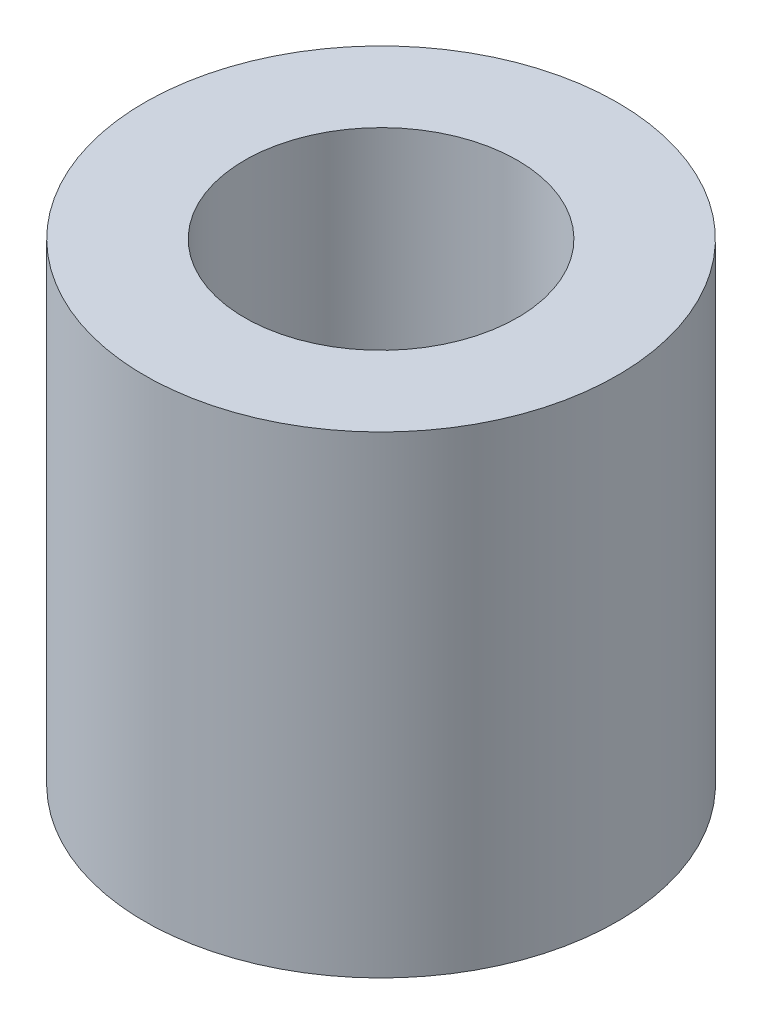
ISO-10303-21;
HEADER;
FILE_DESCRIPTION(('STEP AP214'),'2;1');
FILE_NAME('part.step','',(''),(''),'','','');
FILE_SCHEMA(('AUTOMOTIVE_DESIGN { 1 0 10303 214 1 1 1 1 }'));
ENDSEC;
DATA;
#1=APPLICATION_CONTEXT('core data for automotive mechanical design processes');
#2=APPLICATION_PROTOCOL_DEFINITION('international standard','automotive_design',2000,#1);
#3=PRODUCT_CONTEXT('',#1,'mechanical');
#4=PRODUCT('Part','Part','',(#3));
#5=PRODUCT_RELATED_PRODUCT_CATEGORY('part','',(#4));
#6=PRODUCT_DEFINITION_FORMATION('','',#4);
#7=PRODUCT_DEFINITION_CONTEXT('part definition',#1,'design');
#8=PRODUCT_DEFINITION('design','',#6,#7);
#9=PRODUCT_DEFINITION_SHAPE('','',#8);
#10=(LENGTH_UNIT() NAMED_UNIT(*) SI_UNIT(.MILLI.,.METRE.));
#11=(NAMED_UNIT(*) PLANE_ANGLE_UNIT() SI_UNIT($,.RADIAN.));
#12=(NAMED_UNIT(*) SI_UNIT($,.STERADIAN.) SOLID_ANGLE_UNIT());
#13=UNCERTAINTY_MEASURE_WITH_UNIT(LENGTH_MEASURE(1.E-05),#10,'distance_accuracy_value','');
#14=(GEOMETRIC_REPRESENTATION_CONTEXT(3) GLOBAL_UNCERTAINTY_ASSIGNED_CONTEXT((#13)) GLOBAL_UNIT_ASSIGNED_CONTEXT((#10,
#11,#12)) REPRESENTATION_CONTEXT('',''));
#15=CARTESIAN_POINT('',(0.,0.,0.));
#16=DIRECTION('',(0.,0.,1.));
#17=DIRECTION('',(1.,0.,0.));
#18=AXIS2_PLACEMENT_3D('',#15,#16,#17);
#19=CARTESIAN_POINT('',(0.,10.31875,0.));
#20=DIRECTION('',(0.,-1.,0.));
#21=DIRECTION('',(0.,0.,-1.));
#22=AXIS2_PLACEMENT_3D('',#19,#20,#21);
#23=PLANE('',#22);
#24=CARTESIAN_POINT('',(0.,10.31875,0.));
#25=DIRECTION('',(0.,-1.,0.));
#26=DIRECTION('',(0.,0.,-1.));
#27=AXIS2_PLACEMENT_3D('',#24,#25,#26);
#28=CIRCLE('',#27,10.31875);
#29=CARTESIAN_POINT('',(0.,10.31875,-10.31875));
#30=VERTEX_POINT('',#29);
#31=EDGE_CURVE('E55',#30,#30,#28,.T.);
#32=ORIENTED_EDGE('',*,*,#31,.F.);
#33=EDGE_LOOP('',(#32));
#34=FACE_BOUND('',#33,.T.);
#35=CARTESIAN_POINT('',(0.,10.31875,0.));
#36=DIRECTION('',(0.,-1.,0.));
#37=DIRECTION('',(0.,0.,-1.));
#38=AXIS2_PLACEMENT_3D('',#35,#36,#37);
#39=CIRCLE('',#38,5.953125);
#40=CARTESIAN_POINT('',(0.,10.31875,-5.953125));
#41=VERTEX_POINT('',#40);
#42=EDGE_CURVE('E10',#41,#41,#39,.T.);
#43=ORIENTED_EDGE('',*,*,#42,.T.);
#44=EDGE_LOOP('',(#43));
#45=FACE_BOUND('',#44,.T.);
#46=ADVANCED_FACE('F33',(#34,#45),#23,.F.);
#47=CARTESIAN_POINT('',(0.,0.,0.));
#48=DIRECTION('',(0.,-1.,0.));
#49=DIRECTION('',(0.,0.,-1.));
#50=AXIS2_PLACEMENT_3D('',#47,#48,#49);
#51=CYLINDRICAL_SURFACE('',#50,5.953125);
#52=CARTESIAN_POINT('',(0.,-0.793749999999999,0.));
#53=DIRECTION('',(0.,-1.,0.));
#54=DIRECTION('',(0.,0.,-1.));
#55=AXIS2_PLACEMENT_3D('',#52,#53,#54);
#56=CIRCLE('',#55,5.953125);
#57=CARTESIAN_POINT('',(0.,-0.793749999999999,-5.953125));
#58=VERTEX_POINT('',#57);
#59=EDGE_CURVE('E39',#58,#58,#56,.T.);
#60=ORIENTED_EDGE('',*,*,#59,.T.);
#61=EDGE_LOOP('',(#60));
#62=FACE_BOUND('',#61,.T.);
#63=ORIENTED_EDGE('',*,*,#42,.F.);
#64=EDGE_LOOP('',(#63));
#65=FACE_BOUND('',#64,.T.);
#66=ADVANCED_FACE('F63',(#62,#65),#51,.F.);
#67=CARTESIAN_POINT('',(0.,-0.79375,0.));
#68=DIRECTION('',(0.,-1.,0.));
#69=DIRECTION('',(0.,0.,-1.));
#70=AXIS2_PLACEMENT_3D('',#67,#68,#69);
#71=PLANE('',#70);
#72=ORIENTED_EDGE('',*,*,#59,.F.);
#73=EDGE_LOOP('',(#72));
#74=FACE_BOUND('',#73,.T.);
#75=CARTESIAN_POINT('',(0.,-0.79375,0.));
#76=DIRECTION('',(0.,-1.,0.));
#77=DIRECTION('',(0.,0.,-1.));
#78=AXIS2_PLACEMENT_3D('',#75,#76,#77);
#79=CIRCLE('',#78,3.175);
#80=CARTESIAN_POINT('',(0.,-0.79375,-3.175));
#81=VERTEX_POINT('',#80);
#82=EDGE_CURVE('E43',#81,#81,#79,.T.);
#83=ORIENTED_EDGE('',*,*,#82,.T.);
#84=EDGE_LOOP('',(#83));
#85=FACE_BOUND('',#84,.T.);
#86=ADVANCED_FACE('F67',(#74,#85),#71,.F.);
#87=CARTESIAN_POINT('',(0.,0.,0.));
#88=DIRECTION('',(0.,-1.,0.));
#89=DIRECTION('',(0.,0.,-1.));
#90=AXIS2_PLACEMENT_3D('',#87,#88,#89);
#91=CYLINDRICAL_SURFACE('',#90,3.175);
#92=ORIENTED_EDGE('',*,*,#82,.F.);
#93=EDGE_LOOP('',(#92));
#94=FACE_BOUND('',#93,.T.);
#95=CARTESIAN_POINT('',(0.,-10.31875,0.));
#96=DIRECTION('',(0.,-1.,0.));
#97=DIRECTION('',(0.,0.,-1.));
#98=AXIS2_PLACEMENT_3D('',#95,#96,#97);
#99=CIRCLE('',#98,3.175);
#100=CARTESIAN_POINT('',(0.,-10.31875,-3.175));
#101=VERTEX_POINT('',#100);
#102=EDGE_CURVE('E47',#101,#101,#99,.T.);
#103=ORIENTED_EDGE('',*,*,#102,.T.);
#104=EDGE_LOOP('',(#103));
#105=FACE_BOUND('',#104,.T.);
#106=ADVANCED_FACE('F71',(#94,#105),#91,.F.);
#107=CARTESIAN_POINT('',(0.,-10.31875,0.));
#108=DIRECTION('',(0.,-1.,0.));
#109=DIRECTION('',(0.,0.,-1.));
#110=AXIS2_PLACEMENT_3D('',#107,#108,#109);
#111=PLANE('',#110);
#112=CARTESIAN_POINT('',(0.,-10.31875,0.));
#113=DIRECTION('',(0.,-1.,0.));
#114=DIRECTION('',(0.,0.,-1.));
#115=AXIS2_PLACEMENT_3D('',#112,#113,#114);
#116=CIRCLE('',#115,10.31875);
#117=CARTESIAN_POINT('',(0.,-10.31875,-10.31875));
#118=VERTEX_POINT('',#117);
#119=EDGE_CURVE('E52',#118,#118,#116,.T.);
#120=ORIENTED_EDGE('',*,*,#119,.T.);
#121=EDGE_LOOP('',(#120));
#122=FACE_BOUND('',#121,.T.);
#123=ORIENTED_EDGE('',*,*,#102,.F.);
#124=EDGE_LOOP('',(#123));
#125=FACE_BOUND('',#124,.T.);
#126=ADVANCED_FACE('F78',(#122,#125),#111,.T.);
#127=CARTESIAN_POINT('',(0.,0.,0.));
#128=DIRECTION('',(0.,-1.,0.));
#129=DIRECTION('',(0.,0.,-1.));
#130=AXIS2_PLACEMENT_3D('',#127,#128,#129);
#131=CYLINDRICAL_SURFACE('',#130,10.31875);
#132=ORIENTED_EDGE('',*,*,#31,.T.);
#133=EDGE_LOOP('',(#132));
#134=FACE_BOUND('',#133,.T.);
#135=ORIENTED_EDGE('',*,*,#119,.F.);
#136=EDGE_LOOP('',(#135));
#137=FACE_BOUND('',#136,.T.);
#138=ADVANCED_FACE('F59',(#134,#137),#131,.T.);
#139=CLOSED_SHELL('',(#46,#66,#86,#106,#126,#138));
#140=MANIFOLD_SOLID_BREP('B2',#139);
#141=ADVANCED_BREP_SHAPE_REPRESENTATION('',(#18,#140),#14);
#142=SHAPE_DEFINITION_REPRESENTATION(#9,#141);
ENDSEC;
END-ISO-10303-21;
